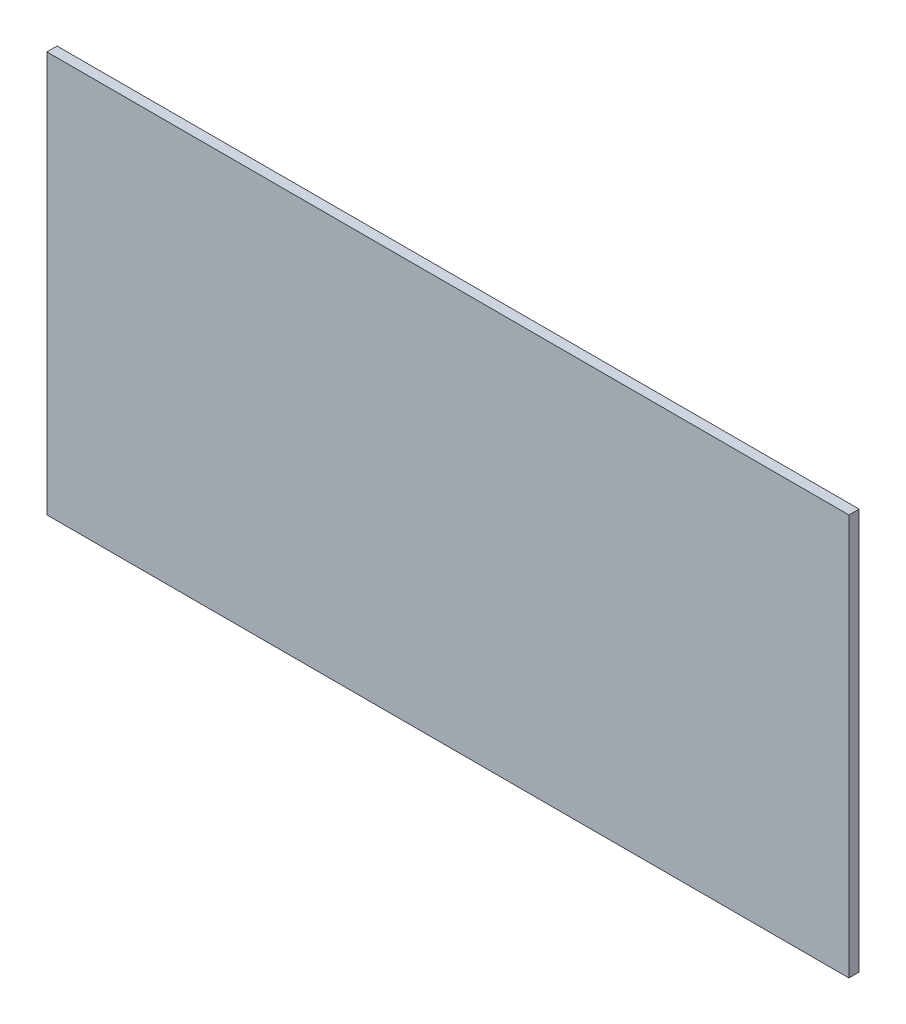
ISO-10303-21;
HEADER;
FILE_DESCRIPTION(('STEP AP214'),'2;1');
FILE_NAME('part.step','',(''),(''),'','','');
FILE_SCHEMA(('AUTOMOTIVE_DESIGN { 1 0 10303 214 1 1 1 1 }'));
ENDSEC;
DATA;
#1=APPLICATION_CONTEXT('core data for automotive mechanical design processes');
#2=APPLICATION_PROTOCOL_DEFINITION('international standard','automotive_design',2000,#1);
#3=PRODUCT_CONTEXT('',#1,'mechanical');
#4=PRODUCT('Part','Part','',(#3));
#5=PRODUCT_RELATED_PRODUCT_CATEGORY('part','',(#4));
#6=PRODUCT_DEFINITION_FORMATION('','',#4);
#7=PRODUCT_DEFINITION_CONTEXT('part definition',#1,'design');
#8=PRODUCT_DEFINITION('design','',#6,#7);
#9=PRODUCT_DEFINITION_SHAPE('','',#8);
#10=(LENGTH_UNIT() NAMED_UNIT(*) SI_UNIT(.MILLI.,.METRE.));
#11=(NAMED_UNIT(*) PLANE_ANGLE_UNIT() SI_UNIT($,.RADIAN.));
#12=(NAMED_UNIT(*) SI_UNIT($,.STERADIAN.) SOLID_ANGLE_UNIT());
#13=UNCERTAINTY_MEASURE_WITH_UNIT(LENGTH_MEASURE(1.E-05),#10,'distance_accuracy_value','');
#14=(GEOMETRIC_REPRESENTATION_CONTEXT(3) GLOBAL_UNCERTAINTY_ASSIGNED_CONTEXT((#13)) GLOBAL_UNIT_ASSIGNED_CONTEXT((#10,
#11,#12)) REPRESENTATION_CONTEXT('',''));
#15=CARTESIAN_POINT('',(0.,0.,0.));
#16=DIRECTION('',(0.,0.,1.));
#17=DIRECTION('',(1.,0.,0.));
#18=AXIS2_PLACEMENT_3D('',#15,#16,#17);
#19=CARTESIAN_POINT('',(1.5,0.5,0.0254));
#20=DIRECTION('',(0.,0.,-1.));
#21=DIRECTION('',(-1.,0.,0.));
#22=AXIS2_PLACEMENT_3D('',#19,#20,#21);
#23=PLANE('',#22);
#24=DIRECTION('',(0.,1.,0.));
#25=VECTOR('',#24,1.);
#26=CARTESIAN_POINT('',(-0.5,0.5,0.0254));
#27=LINE('',#26,#25);
#28=CARTESIAN_POINT('',(-0.5,0.5,0.0254));
#29=VERTEX_POINT('',#28);
#30=CARTESIAN_POINT('',(-0.5,-0.5,0.0254));
#31=VERTEX_POINT('',#30);
#32=EDGE_CURVE('E54',#29,#31,#27,.F.);
#33=ORIENTED_EDGE('',*,*,#32,.T.);
#34=DIRECTION('',(1.,0.,0.));
#35=VECTOR('',#34,1.);
#36=CARTESIAN_POINT('',(-0.5,-0.5,0.0254));
#37=LINE('',#36,#35);
#38=CARTESIAN_POINT('',(1.5,-0.5,0.0254));
#39=VERTEX_POINT('',#38);
#40=EDGE_CURVE('E56',#31,#39,#37,.T.);
#41=ORIENTED_EDGE('',*,*,#40,.T.);
#42=DIRECTION('',(0.,1.,0.));
#43=VECTOR('',#42,1.);
#44=CARTESIAN_POINT('',(1.5,-0.5,0.0254));
#45=LINE('',#44,#43);
#46=CARTESIAN_POINT('',(1.5,0.5,0.0254));
#47=VERTEX_POINT('',#46);
#48=EDGE_CURVE('E19',#39,#47,#45,.T.);
#49=ORIENTED_EDGE('',*,*,#48,.T.);
#50=DIRECTION('',(1.,0.,0.));
#51=VECTOR('',#50,1.);
#52=CARTESIAN_POINT('',(1.5,0.5,0.0254));
#53=LINE('',#52,#51);
#54=EDGE_CURVE('E79',#47,#29,#53,.F.);
#55=ORIENTED_EDGE('',*,*,#54,.T.);
#56=EDGE_LOOP('',(#33,#41,#49,#55));
#57=FACE_BOUND('',#56,.T.);
#58=ADVANCED_FACE('F16',(#57),#23,.F.);
#59=CARTESIAN_POINT('',(1.5,-0.5,0.));
#60=DIRECTION('',(-1.,0.,0.));
#61=DIRECTION('',(0.,0.,1.));
#62=AXIS2_PLACEMENT_3D('',#59,#60,#61);
#63=PLANE('',#62);
#64=DIRECTION('',(0.,0.,-1.));
#65=VECTOR('',#64,1.);
#66=CARTESIAN_POINT('',(1.5,0.5,0.));
#67=LINE('',#66,#65);
#68=CARTESIAN_POINT('',(1.5,0.5,0.));
#69=VERTEX_POINT('',#68);
#70=EDGE_CURVE('E67',#69,#47,#67,.F.);
#71=ORIENTED_EDGE('',*,*,#70,.T.);
#72=ORIENTED_EDGE('',*,*,#48,.F.);
#73=DIRECTION('',(0.,0.,1.));
#74=VECTOR('',#73,1.);
#75=CARTESIAN_POINT('',(1.5,-0.5,0.));
#76=LINE('',#75,#74);
#77=CARTESIAN_POINT('',(1.5,-0.5,0.));
#78=VERTEX_POINT('',#77);
#79=EDGE_CURVE('E62',#39,#78,#76,.F.);
#80=ORIENTED_EDGE('',*,*,#79,.T.);
#81=DIRECTION('',(0.,1.,0.));
#82=VECTOR('',#81,1.);
#83=CARTESIAN_POINT('',(1.5,0.5,0.));
#84=LINE('',#83,#82);
#85=EDGE_CURVE('E82',#69,#78,#84,.F.);
#86=ORIENTED_EDGE('',*,*,#85,.F.);
#87=EDGE_LOOP('',(#71,#72,#80,#86));
#88=FACE_BOUND('',#87,.T.);
#89=ADVANCED_FACE('F64',(#88),#63,.F.);
#90=CARTESIAN_POINT('',(-0.5,-0.5,0.));
#91=DIRECTION('',(0.,1.,0.));
#92=DIRECTION('',(0.,0.,1.));
#93=AXIS2_PLACEMENT_3D('',#90,#91,#92);
#94=PLANE('',#93);
#95=ORIENTED_EDGE('',*,*,#79,.F.);
#96=ORIENTED_EDGE('',*,*,#40,.F.);
#97=DIRECTION('',(0.,0.,-1.));
#98=VECTOR('',#97,1.);
#99=CARTESIAN_POINT('',(-0.5,-0.5,0.));
#100=LINE('',#99,#98);
#101=CARTESIAN_POINT('',(-0.5,-0.5,0.));
#102=VERTEX_POINT('',#101);
#103=EDGE_CURVE('E74',#31,#102,#100,.T.);
#104=ORIENTED_EDGE('',*,*,#103,.T.);
#105=DIRECTION('',(-1.,0.,0.));
#106=VECTOR('',#105,1.);
#107=CARTESIAN_POINT('',(1.5,-0.5,0.));
#108=LINE('',#107,#106);
#109=EDGE_CURVE('E71',#78,#102,#108,.T.);
#110=ORIENTED_EDGE('',*,*,#109,.F.);
#111=EDGE_LOOP('',(#95,#96,#104,#110));
#112=FACE_BOUND('',#111,.T.);
#113=ADVANCED_FACE('F69',(#112),#94,.F.);
#114=CARTESIAN_POINT('',(-0.5,0.5,0.));
#115=DIRECTION('',(1.,0.,0.));
#116=DIRECTION('',(0.,0.,-1.));
#117=AXIS2_PLACEMENT_3D('',#114,#115,#116);
#118=PLANE('',#117);
#119=ORIENTED_EDGE('',*,*,#103,.F.);
#120=ORIENTED_EDGE('',*,*,#32,.F.);
#121=DIRECTION('',(0.,0.,-1.));
#122=VECTOR('',#121,1.);
#123=CARTESIAN_POINT('',(-0.5,0.5,0.));
#124=LINE('',#123,#122);
#125=CARTESIAN_POINT('',(-0.5,0.5,0.));
#126=VERTEX_POINT('',#125);
#127=EDGE_CURVE('E34',#29,#126,#124,.T.);
#128=ORIENTED_EDGE('',*,*,#127,.T.);
#129=DIRECTION('',(0.,1.,0.));
#130=VECTOR('',#129,1.);
#131=CARTESIAN_POINT('',(-0.5,0.5,0.));
#132=LINE('',#131,#130);
#133=EDGE_CURVE('E25',#102,#126,#132,.T.);
#134=ORIENTED_EDGE('',*,*,#133,.F.);
#135=EDGE_LOOP('',(#119,#120,#128,#134));
#136=FACE_BOUND('',#135,.T.);
#137=ADVANCED_FACE('F88',(#136),#118,.F.);
#138=CARTESIAN_POINT('',(1.5,0.5,0.));
#139=DIRECTION('',(0.,-1.,0.));
#140=DIRECTION('',(0.,0.,-1.));
#141=AXIS2_PLACEMENT_3D('',#138,#139,#140);
#142=PLANE('',#141);
#143=ORIENTED_EDGE('',*,*,#127,.F.);
#144=ORIENTED_EDGE('',*,*,#54,.F.);
#145=ORIENTED_EDGE('',*,*,#70,.F.);
#146=DIRECTION('',(-1.,0.,0.));
#147=VECTOR('',#146,1.);
#148=CARTESIAN_POINT('',(1.5,0.5,0.));
#149=LINE('',#148,#147);
#150=EDGE_CURVE('E11',#126,#69,#149,.F.);
#151=ORIENTED_EDGE('',*,*,#150,.F.);
#152=EDGE_LOOP('',(#143,#144,#145,#151));
#153=FACE_BOUND('',#152,.T.);
#154=ADVANCED_FACE('F90',(#153),#142,.F.);
#155=CARTESIAN_POINT('',(1.5,0.5,0.));
#156=DIRECTION('',(0.,0.,-1.));
#157=DIRECTION('',(-1.,0.,0.));
#158=AXIS2_PLACEMENT_3D('',#155,#156,#157);
#159=PLANE('',#158);
#160=ORIENTED_EDGE('',*,*,#133,.T.);
#161=ORIENTED_EDGE('',*,*,#150,.T.);
#162=ORIENTED_EDGE('',*,*,#85,.T.);
#163=ORIENTED_EDGE('',*,*,#109,.T.);
#164=EDGE_LOOP('',(#160,#161,#162,#163));
#165=FACE_BOUND('',#164,.T.);
#166=ADVANCED_FACE('F87',(#165),#159,.T.);
#167=CLOSED_SHELL('',(#58,#89,#113,#137,#154,#166));
#168=MANIFOLD_SOLID_BREP('B1',#167);
#169=ADVANCED_BREP_SHAPE_REPRESENTATION('',(#18,#168),#14);
#170=SHAPE_DEFINITION_REPRESENTATION(#9,#169);
ENDSEC;
END-ISO-10303-21;
